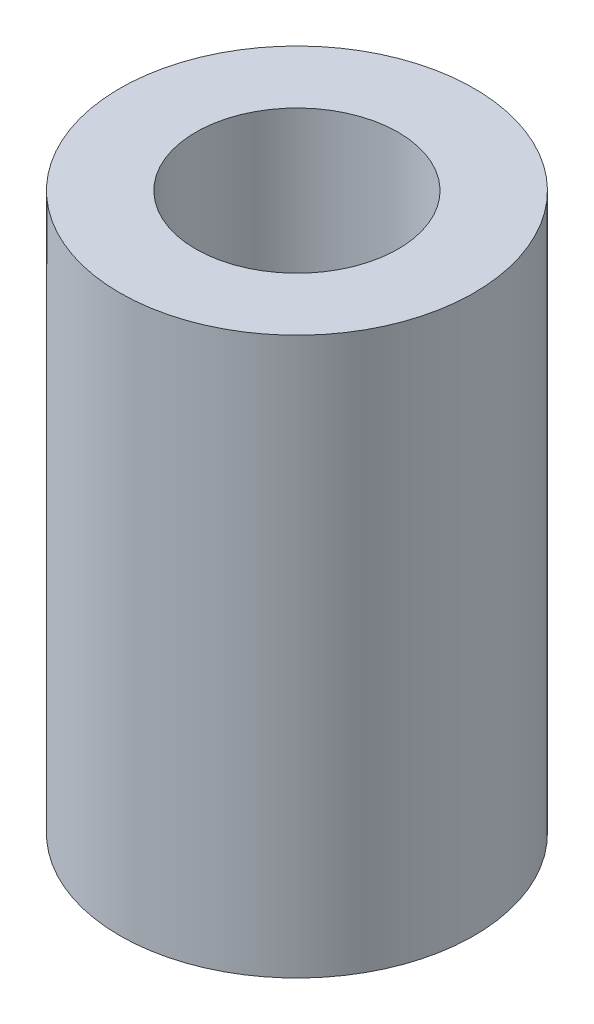
ISO-10303-21;
HEADER;
FILE_DESCRIPTION(('STEP AP214'),'2;1');
FILE_NAME('part.step','',(''),(''),'','','');
FILE_SCHEMA(('AUTOMOTIVE_DESIGN { 1 0 10303 214 1 1 1 1 }'));
ENDSEC;
DATA;
#1=APPLICATION_CONTEXT('core data for automotive mechanical design processes');
#2=APPLICATION_PROTOCOL_DEFINITION('international standard','automotive_design',2000,#1);
#3=PRODUCT_CONTEXT('',#1,'mechanical');
#4=PRODUCT('Part','Part','',(#3));
#5=PRODUCT_RELATED_PRODUCT_CATEGORY('part','',(#4));
#6=PRODUCT_DEFINITION_FORMATION('','',#4);
#7=PRODUCT_DEFINITION_CONTEXT('part definition',#1,'design');
#8=PRODUCT_DEFINITION('design','',#6,#7);
#9=PRODUCT_DEFINITION_SHAPE('','',#8);
#10=(LENGTH_UNIT() NAMED_UNIT(*) SI_UNIT(.MILLI.,.METRE.));
#11=(NAMED_UNIT(*) PLANE_ANGLE_UNIT() SI_UNIT($,.RADIAN.));
#12=(NAMED_UNIT(*) SI_UNIT($,.STERADIAN.) SOLID_ANGLE_UNIT());
#13=UNCERTAINTY_MEASURE_WITH_UNIT(LENGTH_MEASURE(1.E-05),#10,'distance_accuracy_value','');
#14=(GEOMETRIC_REPRESENTATION_CONTEXT(3) GLOBAL_UNCERTAINTY_ASSIGNED_CONTEXT((#13)) GLOBAL_UNIT_ASSIGNED_CONTEXT((#10,
#11,#12)) REPRESENTATION_CONTEXT('',''));
#15=CARTESIAN_POINT('',(0.,0.,0.));
#16=DIRECTION('',(0.,0.,1.));
#17=DIRECTION('',(1.,0.,0.));
#18=AXIS2_PLACEMENT_3D('',#15,#16,#17);
#19=CARTESIAN_POINT('',(0.,22.,0.));
#20=DIRECTION('',(0.,-1.,0.));
#21=DIRECTION('',(0.,0.,-1.));
#22=AXIS2_PLACEMENT_3D('',#19,#20,#21);
#23=CYLINDRICAL_SURFACE('',#22,2.5);
#24=CARTESIAN_POINT('',(0.,0.,0.));
#25=DIRECTION('',(0.,1.,0.));
#26=DIRECTION('',(0.,0.,1.));
#27=AXIS2_PLACEMENT_3D('',#24,#25,#26);
#28=CIRCLE('',#27,2.5);
#29=CARTESIAN_POINT('',(0.,0.,2.5));
#30=VERTEX_POINT('',#29);
#31=EDGE_CURVE('E57',#30,#30,#28,.T.);
#32=ORIENTED_EDGE('',*,*,#31,.F.);
#33=EDGE_LOOP('',(#32));
#34=FACE_BOUND('',#33,.T.);
#35=CARTESIAN_POINT('',(0.,11.,0.));
#36=DIRECTION('',(0.,1.,0.));
#37=DIRECTION('',(0.,0.,1.));
#38=AXIS2_PLACEMENT_3D('',#35,#36,#37);
#39=CIRCLE('',#38,2.5);
#40=CARTESIAN_POINT('',(0.,11.,2.5));
#41=VERTEX_POINT('',#40);
#42=EDGE_CURVE('E43',#41,#41,#39,.T.);
#43=ORIENTED_EDGE('',*,*,#42,.T.);
#44=EDGE_LOOP('',(#43));
#45=FACE_BOUND('',#44,.T.);
#46=ADVANCED_FACE('F39',(#34,#45),#23,.F.);
#47=CARTESIAN_POINT('',(0.,22.,0.));
#48=DIRECTION('',(0.,1.,0.));
#49=DIRECTION('',(0.,0.,1.));
#50=AXIS2_PLACEMENT_3D('',#47,#48,#49);
#51=PLANE('',#50);
#52=CARTESIAN_POINT('',(0.,22.,0.));
#53=DIRECTION('',(0.,1.,0.));
#54=DIRECTION('',(0.,0.,1.));
#55=AXIS2_PLACEMENT_3D('',#52,#53,#54);
#56=CIRCLE('',#55,4.);
#57=CARTESIAN_POINT('',(0.,22.,4.));
#58=VERTEX_POINT('',#57);
#59=EDGE_CURVE('E62',#58,#58,#56,.T.);
#60=ORIENTED_EDGE('',*,*,#59,.F.);
#61=EDGE_LOOP('',(#60));
#62=FACE_BOUND('',#61,.T.);
#63=CARTESIAN_POINT('',(0.,22.,0.));
#64=DIRECTION('',(0.,1.,0.));
#65=DIRECTION('',(0.,0.,1.));
#66=AXIS2_PLACEMENT_3D('',#63,#64,#65);
#67=CIRCLE('',#66,7.);
#68=CARTESIAN_POINT('',(0.,22.,7.));
#69=VERTEX_POINT('',#68);
#70=EDGE_CURVE('E10',#69,#69,#67,.T.);
#71=ORIENTED_EDGE('',*,*,#70,.T.);
#72=EDGE_LOOP('',(#71));
#73=FACE_BOUND('',#72,.T.);
#74=ADVANCED_FACE('F88',(#62,#73),#51,.T.);
#75=CARTESIAN_POINT('',(0.,0.,0.));
#76=DIRECTION('',(0.,1.,0.));
#77=DIRECTION('',(0.,0.,1.));
#78=AXIS2_PLACEMENT_3D('',#75,#76,#77);
#79=PLANE('',#78);
#80=CARTESIAN_POINT('',(0.,0.,0.));
#81=DIRECTION('',(0.,1.,0.));
#82=DIRECTION('',(0.,0.,1.));
#83=AXIS2_PLACEMENT_3D('',#80,#81,#82);
#84=CIRCLE('',#83,7.);
#85=CARTESIAN_POINT('',(0.,0.,7.));
#86=VERTEX_POINT('',#85);
#87=EDGE_CURVE('E48',#86,#86,#84,.T.);
#88=ORIENTED_EDGE('',*,*,#87,.F.);
#89=EDGE_LOOP('',(#88));
#90=FACE_BOUND('',#89,.T.);
#91=ORIENTED_EDGE('',*,*,#31,.T.);
#92=EDGE_LOOP('',(#91));
#93=FACE_BOUND('',#92,.T.);
#94=ADVANCED_FACE('F93',(#90,#93),#79,.F.);
#95=CARTESIAN_POINT('',(0.,22.,0.));
#96=DIRECTION('',(0.,-1.,0.));
#97=DIRECTION('',(0.,0.,-1.));
#98=AXIS2_PLACEMENT_3D('',#95,#96,#97);
#99=CYLINDRICAL_SURFACE('',#98,7.);
#100=ORIENTED_EDGE('',*,*,#70,.F.);
#101=EDGE_LOOP('',(#100));
#102=FACE_BOUND('',#101,.T.);
#103=ORIENTED_EDGE('',*,*,#87,.T.);
#104=EDGE_LOOP('',(#103));
#105=FACE_BOUND('',#104,.T.);
#106=ADVANCED_FACE('F41',(#102,#105),#99,.T.);
#107=CARTESIAN_POINT('',(0.,11.,0.));
#108=DIRECTION('',(0.,1.,0.));
#109=DIRECTION('',(0.,0.,1.));
#110=AXIS2_PLACEMENT_3D('',#107,#108,#109);
#111=CYLINDRICAL_SURFACE('',#110,4.);
#112=CARTESIAN_POINT('',(0.,11.,0.));
#113=DIRECTION('',(0.,1.,0.));
#114=DIRECTION('',(0.,0.,1.));
#115=AXIS2_PLACEMENT_3D('',#112,#113,#114);
#116=CIRCLE('',#115,4.);
#117=CARTESIAN_POINT('',(0.,11.,4.));
#118=VERTEX_POINT('',#117);
#119=EDGE_CURVE('E66',#118,#118,#116,.T.);
#120=ORIENTED_EDGE('',*,*,#119,.F.);
#121=EDGE_LOOP('',(#120));
#122=FACE_BOUND('',#121,.T.);
#123=ORIENTED_EDGE('',*,*,#59,.T.);
#124=EDGE_LOOP('',(#123));
#125=FACE_BOUND('',#124,.T.);
#126=ADVANCED_FACE('F80',(#122,#125),#111,.F.);
#127=CARTESIAN_POINT('',(0.,11.,0.));
#128=DIRECTION('',(0.,1.,0.));
#129=DIRECTION('',(0.,0.,1.));
#130=AXIS2_PLACEMENT_3D('',#127,#128,#129);
#131=PLANE('',#130);
#132=ORIENTED_EDGE('',*,*,#42,.F.);
#133=EDGE_LOOP('',(#132));
#134=FACE_BOUND('',#133,.T.);
#135=ORIENTED_EDGE('',*,*,#119,.T.);
#136=EDGE_LOOP('',(#135));
#137=FACE_BOUND('',#136,.T.);
#138=ADVANCED_FACE('F78',(#134,#137),#131,.T.);
#139=CLOSED_SHELL('',(#46,#74,#94,#106,#126,#138));
#140=MANIFOLD_SOLID_BREP('B2',#139);
#141=ADVANCED_BREP_SHAPE_REPRESENTATION('',(#18,#140),#14);
#142=SHAPE_DEFINITION_REPRESENTATION(#9,#141);
ENDSEC;
END-ISO-10303-21;
